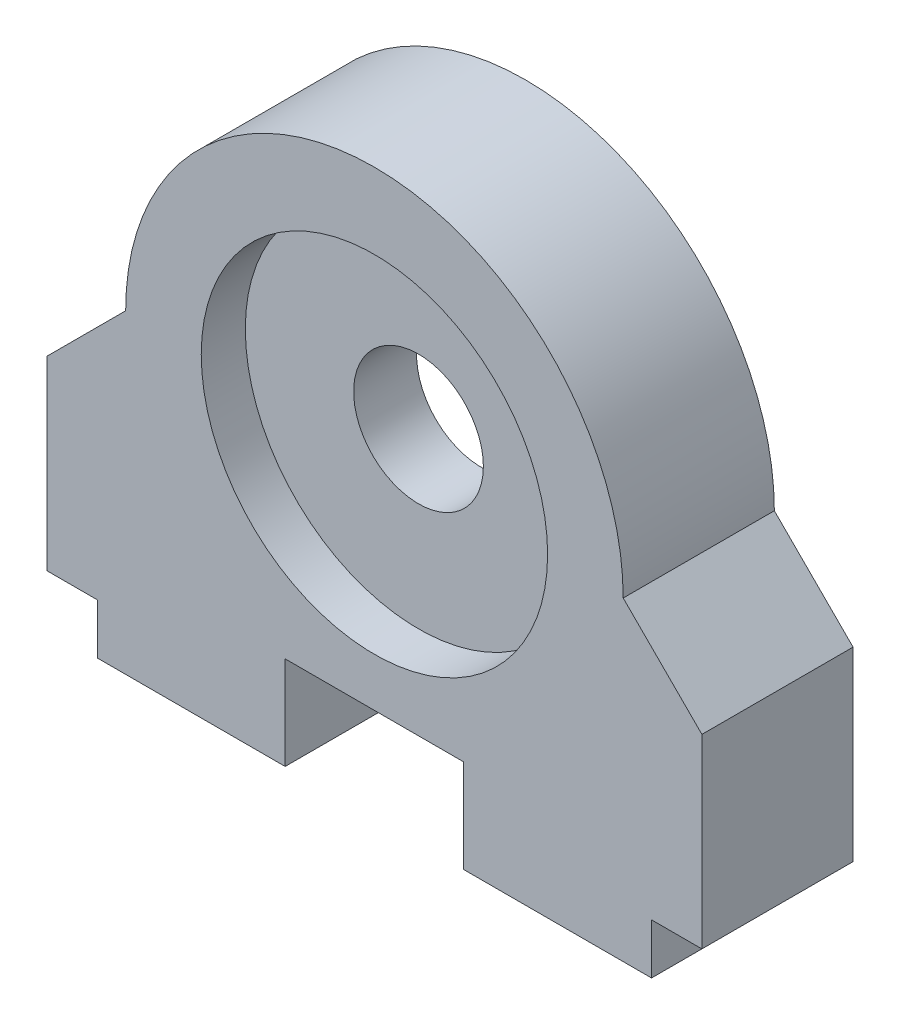
ISO-10303-21;
HEADER;
FILE_DESCRIPTION(('STEP AP214'),'2;1');
FILE_NAME('part.step','',(''),(''),'','','');
FILE_SCHEMA(('AUTOMOTIVE_DESIGN { 1 0 10303 214 1 1 1 1 }'));
ENDSEC;
DATA;
#1=APPLICATION_CONTEXT('core data for automotive mechanical design processes');
#2=APPLICATION_PROTOCOL_DEFINITION('international standard','automotive_design',2000,#1);
#3=PRODUCT_CONTEXT('',#1,'mechanical');
#4=PRODUCT('Part','Part','',(#3));
#5=PRODUCT_RELATED_PRODUCT_CATEGORY('part','',(#4));
#6=PRODUCT_DEFINITION_FORMATION('','',#4);
#7=PRODUCT_DEFINITION_CONTEXT('part definition',#1,'design');
#8=PRODUCT_DEFINITION('design','',#6,#7);
#9=PRODUCT_DEFINITION_SHAPE('','',#8);
#10=(LENGTH_UNIT() NAMED_UNIT(*) SI_UNIT(.MILLI.,.METRE.));
#11=(NAMED_UNIT(*) PLANE_ANGLE_UNIT() SI_UNIT($,.RADIAN.));
#12=(NAMED_UNIT(*) SI_UNIT($,.STERADIAN.) SOLID_ANGLE_UNIT());
#13=UNCERTAINTY_MEASURE_WITH_UNIT(LENGTH_MEASURE(1.E-05),#10,'distance_accuracy_value','');
#14=(GEOMETRIC_REPRESENTATION_CONTEXT(3) GLOBAL_UNCERTAINTY_ASSIGNED_CONTEXT((#13)) GLOBAL_UNIT_ASSIGNED_CONTEXT((#10,
#11,#12)) REPRESENTATION_CONTEXT('',''));
#15=CARTESIAN_POINT('',(0.,0.,0.));
#16=DIRECTION('',(0.,0.,1.));
#17=DIRECTION('',(1.,0.,0.));
#18=AXIS2_PLACEMENT_3D('',#15,#16,#17);
#19=CARTESIAN_POINT('',(0.,15.875,7.62));
#20=DIRECTION('',(0.,0.,-1.));
#21=DIRECTION('',(-1.,0.,0.));
#22=AXIS2_PLACEMENT_3D('',#19,#20,#21);
#23=CYLINDRICAL_SURFACE('',#22,8.73125);
#24=CARTESIAN_POINT('',(0.,15.875,0.));
#25=DIRECTION('',(0.,0.,1.));
#26=DIRECTION('',(1.,0.,0.));
#27=AXIS2_PLACEMENT_3D('',#24,#25,#26);
#28=CIRCLE('',#27,8.73125);
#29=CARTESIAN_POINT('',(8.73125,15.875,0.));
#30=VERTEX_POINT('',#29);
#31=EDGE_CURVE('E330',#30,#30,#28,.T.);
#32=ORIENTED_EDGE('',*,*,#31,.F.);
#33=EDGE_LOOP('',(#32));
#34=FACE_BOUND('',#33,.T.);
#35=CARTESIAN_POINT('',(0.,15.875,2.2225));
#36=DIRECTION('',(0.,0.,1.));
#37=DIRECTION('',(1.,0.,0.));
#38=AXIS2_PLACEMENT_3D('',#35,#36,#37);
#39=CIRCLE('',#38,8.73125);
#40=CARTESIAN_POINT('',(8.73125,15.875,2.2225));
#41=VERTEX_POINT('',#40);
#42=EDGE_CURVE('E37',#41,#41,#39,.T.);
#43=ORIENTED_EDGE('',*,*,#42,.T.);
#44=EDGE_LOOP('',(#43));
#45=FACE_BOUND('',#44,.T.);
#46=ADVANCED_FACE('F33',(#34,#45),#23,.F.);
#47=CARTESIAN_POINT('',(0.,15.875,7.62));
#48=DIRECTION('',(0.,0.,-1.));
#49=DIRECTION('',(-1.,0.,0.));
#50=AXIS2_PLACEMENT_3D('',#47,#48,#49);
#51=PLANE('',#50);
#52=DIRECTION('',(0.,-1.,0.));
#53=VECTOR('',#52,1.);
#54=CARTESIAN_POINT('',(-13.97,0.,7.62));
#55=LINE('',#54,#53);
#56=CARTESIAN_POINT('',(-13.97,2.54,7.62));
#57=VERTEX_POINT('',#56);
#58=CARTESIAN_POINT('',(-13.97,0.,7.62));
#59=VERTEX_POINT('',#58);
#60=EDGE_CURVE('E196',#57,#59,#55,.T.);
#61=ORIENTED_EDGE('',*,*,#60,.T.);
#62=DIRECTION('',(1.,0.,0.));
#63=VECTOR('',#62,1.);
#64=CARTESIAN_POINT('',(-4.5,0.,7.62));
#65=LINE('',#64,#63);
#66=CARTESIAN_POINT('',(-4.5,0.,7.62));
#67=VERTEX_POINT('',#66);
#68=EDGE_CURVE('E113',#59,#67,#65,.T.);
#69=ORIENTED_EDGE('',*,*,#68,.T.);
#70=DIRECTION('',(0.,1.,0.));
#71=VECTOR('',#70,1.);
#72=CARTESIAN_POINT('',(-4.5,4.699,7.62));
#73=LINE('',#72,#71);
#74=CARTESIAN_POINT('',(-4.5,4.699,7.62));
#75=VERTEX_POINT('',#74);
#76=EDGE_CURVE('E249',#67,#75,#73,.T.);
#77=ORIENTED_EDGE('',*,*,#76,.T.);
#78=DIRECTION('',(1.,0.,0.));
#79=VECTOR('',#78,1.);
#80=CARTESIAN_POINT('',(4.5,4.699,7.62));
#81=LINE('',#80,#79);
#82=CARTESIAN_POINT('',(4.5,4.699,7.62));
#83=VERTEX_POINT('',#82);
#84=EDGE_CURVE('E246',#75,#83,#81,.T.);
#85=ORIENTED_EDGE('',*,*,#84,.T.);
#86=DIRECTION('',(0.,-1.,0.));
#87=VECTOR('',#86,1.);
#88=CARTESIAN_POINT('',(4.5,4.699,7.62));
#89=LINE('',#88,#87);
#90=CARTESIAN_POINT('',(4.5,0.,7.62));
#91=VERTEX_POINT('',#90);
#92=EDGE_CURVE('E248',#83,#91,#89,.T.);
#93=ORIENTED_EDGE('',*,*,#92,.T.);
#94=DIRECTION('',(1.,0.,0.));
#95=VECTOR('',#94,1.);
#96=CARTESIAN_POINT('',(4.5,0.,7.62));
#97=LINE('',#96,#95);
#98=CARTESIAN_POINT('',(13.97,0.,7.62));
#99=VERTEX_POINT('',#98);
#100=EDGE_CURVE('E251',#91,#99,#97,.T.);
#101=ORIENTED_EDGE('',*,*,#100,.T.);
#102=DIRECTION('',(0.,1.,0.));
#103=VECTOR('',#102,1.);
#104=CARTESIAN_POINT('',(13.97,0.,7.62));
#105=LINE('',#104,#103);
#106=CARTESIAN_POINT('',(13.97,2.54,7.62));
#107=VERTEX_POINT('',#106);
#108=EDGE_CURVE('E257',#99,#107,#105,.T.);
#109=ORIENTED_EDGE('',*,*,#108,.T.);
#110=DIRECTION('',(1.,0.,0.));
#111=VECTOR('',#110,1.);
#112=CARTESIAN_POINT('',(16.51,2.54,7.62));
#113=LINE('',#112,#111);
#114=CARTESIAN_POINT('',(16.51,2.54,7.62));
#115=VERTEX_POINT('',#114);
#116=EDGE_CURVE('E259',#107,#115,#113,.T.);
#117=ORIENTED_EDGE('',*,*,#116,.T.);
#118=DIRECTION('',(0.,1.,0.));
#119=VECTOR('',#118,1.);
#120=CARTESIAN_POINT('',(16.51,2.54,7.62));
#121=LINE('',#120,#119);
#122=CARTESIAN_POINT('',(16.51,11.90625,7.62));
#123=VERTEX_POINT('',#122);
#124=EDGE_CURVE('E261',#115,#123,#121,.T.);
#125=ORIENTED_EDGE('',*,*,#124,.T.);
#126=DIRECTION('',(-0.707106781186549,0.707106781186546,0.));
#127=VECTOR('',#126,1.);
#128=CARTESIAN_POINT('',(16.51,11.90625,7.62));
#129=LINE('',#128,#127);
#130=CARTESIAN_POINT('',(12.54125,15.875,7.62));
#131=VERTEX_POINT('',#130);
#132=EDGE_CURVE('E263',#123,#131,#129,.T.);
#133=ORIENTED_EDGE('',*,*,#132,.T.);
#134=CARTESIAN_POINT('',(0.,15.875,7.62));
#135=DIRECTION('',(0.,0.,1.));
#136=DIRECTION('',(-1.,0.,0.));
#137=AXIS2_PLACEMENT_3D('',#134,#135,#136);
#138=CIRCLE('',#137,12.54125);
#139=CARTESIAN_POINT('',(-12.54125,15.875,7.62));
#140=VERTEX_POINT('',#139);
#141=EDGE_CURVE('E151',#131,#140,#138,.T.);
#142=ORIENTED_EDGE('',*,*,#141,.T.);
#143=DIRECTION('',(-0.707106781186549,-0.707106781186546,0.));
#144=VECTOR('',#143,1.);
#145=CARTESIAN_POINT('',(-16.51,11.90625,7.62));
#146=LINE('',#145,#144);
#147=CARTESIAN_POINT('',(-16.51,11.90625,7.62));
#148=VERTEX_POINT('',#147);
#149=EDGE_CURVE('E144',#140,#148,#146,.T.);
#150=ORIENTED_EDGE('',*,*,#149,.T.);
#151=DIRECTION('',(0.,-1.,0.));
#152=VECTOR('',#151,1.);
#153=CARTESIAN_POINT('',(-16.51,2.54,7.62));
#154=LINE('',#153,#152);
#155=CARTESIAN_POINT('',(-16.51,2.54,7.62));
#156=VERTEX_POINT('',#155);
#157=EDGE_CURVE('E149',#148,#156,#154,.T.);
#158=ORIENTED_EDGE('',*,*,#157,.T.);
#159=DIRECTION('',(1.,0.,0.));
#160=VECTOR('',#159,1.);
#161=CARTESIAN_POINT('',(-16.51,2.54,7.62));
#162=LINE('',#161,#160);
#163=EDGE_CURVE('E51',#156,#57,#162,.T.);
#164=ORIENTED_EDGE('',*,*,#163,.T.);
#165=EDGE_LOOP('',(#61,#69,#77,#85,#93,#101,#109,#117,#125,#133,#142,#150,#158,#164));
#166=FACE_BOUND('',#165,.T.);
#167=CARTESIAN_POINT('',(0.,15.875,7.62));
#168=DIRECTION('',(0.,0.,1.));
#169=DIRECTION('',(1.,0.,0.));
#170=AXIS2_PLACEMENT_3D('',#167,#168,#169);
#171=CIRCLE('',#170,8.73125);
#172=CARTESIAN_POINT('',(8.73125,15.875,7.62));
#173=VERTEX_POINT('',#172);
#174=EDGE_CURVE('E173',#173,#173,#171,.T.);
#175=ORIENTED_EDGE('',*,*,#174,.F.);
#176=EDGE_LOOP('',(#175));
#177=FACE_BOUND('',#176,.T.);
#178=ADVANCED_FACE('F146',(#166,#177),#51,.F.);
#179=CARTESIAN_POINT('',(0.,15.875,0.));
#180=DIRECTION('',(0.,0.,-1.));
#181=DIRECTION('',(-1.,0.,0.));
#182=AXIS2_PLACEMENT_3D('',#179,#180,#181);
#183=PLANE('',#182);
#184=DIRECTION('',(0.,-1.,0.));
#185=VECTOR('',#184,1.);
#186=CARTESIAN_POINT('',(-13.97,0.,0.));
#187=LINE('',#186,#185);
#188=CARTESIAN_POINT('',(-13.97,2.54,0.));
#189=VERTEX_POINT('',#188);
#190=CARTESIAN_POINT('',(-13.97,0.,0.));
#191=VERTEX_POINT('',#190);
#192=EDGE_CURVE('E169',#189,#191,#187,.T.);
#193=ORIENTED_EDGE('',*,*,#192,.F.);
#194=DIRECTION('',(1.,0.,0.));
#195=VECTOR('',#194,1.);
#196=CARTESIAN_POINT('',(-16.51,2.54,0.));
#197=LINE('',#196,#195);
#198=CARTESIAN_POINT('',(-16.51,2.54,0.));
#199=VERTEX_POINT('',#198);
#200=EDGE_CURVE('E104',#199,#189,#197,.T.);
#201=ORIENTED_EDGE('',*,*,#200,.F.);
#202=DIRECTION('',(0.,-1.,0.));
#203=VECTOR('',#202,1.);
#204=CARTESIAN_POINT('',(-16.51,2.54,0.));
#205=LINE('',#204,#203);
#206=CARTESIAN_POINT('',(-16.51,11.90625,0.));
#207=VERTEX_POINT('',#206);
#208=EDGE_CURVE('E98',#207,#199,#205,.T.);
#209=ORIENTED_EDGE('',*,*,#208,.F.);
#210=DIRECTION('',(-0.707106781186549,-0.707106781186546,0.));
#211=VECTOR('',#210,1.);
#212=CARTESIAN_POINT('',(-16.51,11.90625,0.));
#213=LINE('',#212,#211);
#214=CARTESIAN_POINT('',(-12.54125,15.875,0.));
#215=VERTEX_POINT('',#214);
#216=EDGE_CURVE('E159',#215,#207,#213,.T.);
#217=ORIENTED_EDGE('',*,*,#216,.F.);
#218=CARTESIAN_POINT('',(0.,15.875,0.));
#219=DIRECTION('',(0.,0.,1.));
#220=DIRECTION('',(-1.,0.,0.));
#221=AXIS2_PLACEMENT_3D('',#218,#219,#220);
#222=CIRCLE('',#221,12.54125);
#223=CARTESIAN_POINT('',(12.54125,15.875,0.));
#224=VERTEX_POINT('',#223);
#225=EDGE_CURVE('E191',#224,#215,#222,.T.);
#226=ORIENTED_EDGE('',*,*,#225,.F.);
#227=DIRECTION('',(-0.707106781186549,0.707106781186546,0.));
#228=VECTOR('',#227,1.);
#229=CARTESIAN_POINT('',(16.51,11.90625,0.));
#230=LINE('',#229,#228);
#231=CARTESIAN_POINT('',(16.51,11.90625,0.));
#232=VERTEX_POINT('',#231);
#233=EDGE_CURVE('E189',#232,#224,#230,.T.);
#234=ORIENTED_EDGE('',*,*,#233,.F.);
#235=DIRECTION('',(0.,1.,0.));
#236=VECTOR('',#235,1.);
#237=CARTESIAN_POINT('',(16.51,2.54,0.));
#238=LINE('',#237,#236);
#239=CARTESIAN_POINT('',(16.51,2.54,0.));
#240=VERTEX_POINT('',#239);
#241=EDGE_CURVE('E187',#240,#232,#238,.T.);
#242=ORIENTED_EDGE('',*,*,#241,.F.);
#243=DIRECTION('',(1.,0.,0.));
#244=VECTOR('',#243,1.);
#245=CARTESIAN_POINT('',(16.51,2.54,0.));
#246=LINE('',#245,#244);
#247=CARTESIAN_POINT('',(13.97,2.54,0.));
#248=VERTEX_POINT('',#247);
#249=EDGE_CURVE('E185',#248,#240,#246,.T.);
#250=ORIENTED_EDGE('',*,*,#249,.F.);
#251=DIRECTION('',(0.,1.,0.));
#252=VECTOR('',#251,1.);
#253=CARTESIAN_POINT('',(13.97,0.,0.));
#254=LINE('',#253,#252);
#255=CARTESIAN_POINT('',(13.97,0.,0.));
#256=VERTEX_POINT('',#255);
#257=EDGE_CURVE('E183',#256,#248,#254,.T.);
#258=ORIENTED_EDGE('',*,*,#257,.F.);
#259=DIRECTION('',(1.,0.,0.));
#260=VECTOR('',#259,1.);
#261=CARTESIAN_POINT('',(4.5,0.,0.));
#262=LINE('',#261,#260);
#263=CARTESIAN_POINT('',(4.5,0.,0.));
#264=VERTEX_POINT('',#263);
#265=EDGE_CURVE('E181',#264,#256,#262,.T.);
#266=ORIENTED_EDGE('',*,*,#265,.F.);
#267=DIRECTION('',(0.,-1.,0.));
#268=VECTOR('',#267,1.);
#269=CARTESIAN_POINT('',(4.5,4.699,0.));
#270=LINE('',#269,#268);
#271=CARTESIAN_POINT('',(4.5,4.699,0.));
#272=VERTEX_POINT('',#271);
#273=EDGE_CURVE('E179',#272,#264,#270,.T.);
#274=ORIENTED_EDGE('',*,*,#273,.F.);
#275=DIRECTION('',(1.,0.,0.));
#276=VECTOR('',#275,1.);
#277=CARTESIAN_POINT('',(4.5,4.699,0.));
#278=LINE('',#277,#276);
#279=CARTESIAN_POINT('',(-4.5,4.699,0.));
#280=VERTEX_POINT('',#279);
#281=EDGE_CURVE('E177',#280,#272,#278,.T.);
#282=ORIENTED_EDGE('',*,*,#281,.F.);
#283=DIRECTION('',(0.,1.,0.));
#284=VECTOR('',#283,1.);
#285=CARTESIAN_POINT('',(-4.5,4.699,0.));
#286=LINE('',#285,#284);
#287=CARTESIAN_POINT('',(-4.5,0.,0.));
#288=VERTEX_POINT('',#287);
#289=EDGE_CURVE('E175',#288,#280,#286,.T.);
#290=ORIENTED_EDGE('',*,*,#289,.F.);
#291=DIRECTION('',(1.,0.,0.));
#292=VECTOR('',#291,1.);
#293=CARTESIAN_POINT('',(-4.5,0.,0.));
#294=LINE('',#293,#292);
#295=EDGE_CURVE('E172',#191,#288,#294,.T.);
#296=ORIENTED_EDGE('',*,*,#295,.F.);
#297=EDGE_LOOP('',(#193,#201,#209,#217,#226,#234,#242,#250,#258,#266,#274,#282,#290,#296));
#298=FACE_BOUND('',#297,.T.);
#299=ORIENTED_EDGE('',*,*,#31,.T.);
#300=EDGE_LOOP('',(#299));
#301=FACE_BOUND('',#300,.T.);
#302=ADVANCED_FACE('F233',(#298,#301),#183,.T.);
#303=CARTESIAN_POINT('',(-13.97,0.,7.62));
#304=DIRECTION('',(1.,0.,0.));
#305=DIRECTION('',(0.,0.,-1.));
#306=AXIS2_PLACEMENT_3D('',#303,#304,#305);
#307=PLANE('',#306);
#308=ORIENTED_EDGE('',*,*,#192,.T.);
#309=DIRECTION('',(0.,0.,-1.));
#310=VECTOR('',#309,1.);
#311=CARTESIAN_POINT('',(-13.97,0.,7.62));
#312=LINE('',#311,#310);
#313=EDGE_CURVE('E43',#59,#191,#312,.T.);
#314=ORIENTED_EDGE('',*,*,#313,.F.);
#315=ORIENTED_EDGE('',*,*,#60,.F.);
#316=DIRECTION('',(0.,0.,-1.));
#317=VECTOR('',#316,1.);
#318=CARTESIAN_POINT('',(-13.97,2.54,7.62));
#319=LINE('',#318,#317);
#320=EDGE_CURVE('E165',#57,#189,#319,.T.);
#321=ORIENTED_EDGE('',*,*,#320,.T.);
#322=EDGE_LOOP('',(#308,#314,#315,#321));
#323=FACE_BOUND('',#322,.T.);
#324=ADVANCED_FACE('F35',(#323),#307,.F.);
#325=CARTESIAN_POINT('',(-4.5,0.,7.62));
#326=DIRECTION('',(0.,1.,0.));
#327=DIRECTION('',(-1.,0.,0.));
#328=AXIS2_PLACEMENT_3D('',#325,#326,#327);
#329=PLANE('',#328);
#330=CARTESIAN_POINT('',(-10.16,0.,3.81));
#331=DIRECTION('',(0.,-1.,0.));
#332=DIRECTION('',(-1.,0.,0.));
#333=AXIS2_PLACEMENT_3D('',#330,#331,#332);
#334=CIRCLE('',#333,1.98374);
#335=CARTESIAN_POINT('',(-12.14374,0.,3.81));
#336=VERTEX_POINT('',#335);
#337=EDGE_CURVE('E349',#336,#336,#334,.T.);
#338=ORIENTED_EDGE('',*,*,#337,.F.);
#339=EDGE_LOOP('',(#338));
#340=FACE_BOUND('',#339,.T.);
#341=ORIENTED_EDGE('',*,*,#295,.T.);
#342=DIRECTION('',(0.,0.,-1.));
#343=VECTOR('',#342,1.);
#344=CARTESIAN_POINT('',(-4.5,0.,7.62));
#345=LINE('',#344,#343);
#346=EDGE_CURVE('E224',#67,#288,#345,.T.);
#347=ORIENTED_EDGE('',*,*,#346,.F.);
#348=ORIENTED_EDGE('',*,*,#68,.F.);
#349=ORIENTED_EDGE('',*,*,#313,.T.);
#350=EDGE_LOOP('',(#341,#347,#348,#349));
#351=FACE_BOUND('',#350,.T.);
#352=ADVANCED_FACE('F228',(#340,#351),#329,.F.);
#353=CARTESIAN_POINT('',(-4.5,4.699,7.62));
#354=DIRECTION('',(-1.,0.,0.));
#355=DIRECTION('',(0.,0.,1.));
#356=AXIS2_PLACEMENT_3D('',#353,#354,#355);
#357=PLANE('',#356);
#358=ORIENTED_EDGE('',*,*,#289,.T.);
#359=DIRECTION('',(0.,0.,-1.));
#360=VECTOR('',#359,1.);
#361=CARTESIAN_POINT('',(-4.5,4.699,7.62));
#362=LINE('',#361,#360);
#363=EDGE_CURVE('E221',#75,#280,#362,.T.);
#364=ORIENTED_EDGE('',*,*,#363,.F.);
#365=ORIENTED_EDGE('',*,*,#76,.F.);
#366=ORIENTED_EDGE('',*,*,#346,.T.);
#367=EDGE_LOOP('',(#358,#364,#365,#366));
#368=FACE_BOUND('',#367,.T.);
#369=ADVANCED_FACE('F240',(#368),#357,.F.);
#370=CARTESIAN_POINT('',(4.5,4.699,7.62));
#371=DIRECTION('',(0.,1.,0.));
#372=DIRECTION('',(0.,0.,1.));
#373=AXIS2_PLACEMENT_3D('',#370,#371,#372);
#374=PLANE('',#373);
#375=ORIENTED_EDGE('',*,*,#281,.T.);
#376=DIRECTION('',(0.,0.,-1.));
#377=VECTOR('',#376,1.);
#378=CARTESIAN_POINT('',(4.5,4.699,7.62));
#379=LINE('',#378,#377);
#380=EDGE_CURVE('E218',#83,#272,#379,.T.);
#381=ORIENTED_EDGE('',*,*,#380,.F.);
#382=ORIENTED_EDGE('',*,*,#84,.F.);
#383=ORIENTED_EDGE('',*,*,#363,.T.);
#384=EDGE_LOOP('',(#375,#381,#382,#383));
#385=FACE_BOUND('',#384,.T.);
#386=ADVANCED_FACE('F244',(#385),#374,.F.);
#387=CARTESIAN_POINT('',(4.5,4.699,7.62));
#388=DIRECTION('',(1.,0.,0.));
#389=DIRECTION('',(0.,0.,-1.));
#390=AXIS2_PLACEMENT_3D('',#387,#388,#389);
#391=PLANE('',#390);
#392=ORIENTED_EDGE('',*,*,#273,.T.);
#393=DIRECTION('',(0.,0.,-1.));
#394=VECTOR('',#393,1.);
#395=CARTESIAN_POINT('',(4.5,0.,7.62));
#396=LINE('',#395,#394);
#397=EDGE_CURVE('E215',#91,#264,#396,.T.);
#398=ORIENTED_EDGE('',*,*,#397,.F.);
#399=ORIENTED_EDGE('',*,*,#92,.F.);
#400=ORIENTED_EDGE('',*,*,#380,.T.);
#401=EDGE_LOOP('',(#392,#398,#399,#400));
#402=FACE_BOUND('',#401,.T.);
#403=ADVANCED_FACE('F294',(#402),#391,.F.);
#404=CARTESIAN_POINT('',(4.5,0.,7.62));
#405=DIRECTION('',(0.,1.,0.));
#406=DIRECTION('',(-1.,0.,0.));
#407=AXIS2_PLACEMENT_3D('',#404,#405,#406);
#408=PLANE('',#407);
#409=CARTESIAN_POINT('',(10.16,0.,3.81));
#410=DIRECTION('',(0.,-1.,0.));
#411=DIRECTION('',(1.,0.,0.));
#412=AXIS2_PLACEMENT_3D('',#409,#410,#411);
#413=CIRCLE('',#412,1.98374);
#414=CARTESIAN_POINT('',(12.14374,0.,3.81));
#415=VERTEX_POINT('',#414);
#416=EDGE_CURVE('E343',#415,#415,#413,.T.);
#417=ORIENTED_EDGE('',*,*,#416,.F.);
#418=EDGE_LOOP('',(#417));
#419=FACE_BOUND('',#418,.T.);
#420=ORIENTED_EDGE('',*,*,#265,.T.);
#421=DIRECTION('',(0.,0.,-1.));
#422=VECTOR('',#421,1.);
#423=CARTESIAN_POINT('',(13.97,0.,7.62));
#424=LINE('',#423,#422);
#425=EDGE_CURVE('E212',#99,#256,#424,.T.);
#426=ORIENTED_EDGE('',*,*,#425,.F.);
#427=ORIENTED_EDGE('',*,*,#100,.F.);
#428=ORIENTED_EDGE('',*,*,#397,.T.);
#429=EDGE_LOOP('',(#420,#426,#427,#428));
#430=FACE_BOUND('',#429,.T.);
#431=ADVANCED_FACE('F290',(#419,#430),#408,.F.);
#432=CARTESIAN_POINT('',(13.97,0.,7.62));
#433=DIRECTION('',(-1.,0.,0.));
#434=DIRECTION('',(0.,0.,1.));
#435=AXIS2_PLACEMENT_3D('',#432,#433,#434);
#436=PLANE('',#435);
#437=ORIENTED_EDGE('',*,*,#257,.T.);
#438=DIRECTION('',(0.,0.,-1.));
#439=VECTOR('',#438,1.);
#440=CARTESIAN_POINT('',(13.97,2.54,7.62));
#441=LINE('',#440,#439);
#442=EDGE_CURVE('E209',#107,#248,#441,.T.);
#443=ORIENTED_EDGE('',*,*,#442,.F.);
#444=ORIENTED_EDGE('',*,*,#108,.F.);
#445=ORIENTED_EDGE('',*,*,#425,.T.);
#446=EDGE_LOOP('',(#437,#443,#444,#445));
#447=FACE_BOUND('',#446,.T.);
#448=ADVANCED_FACE('F286',(#447),#436,.F.);
#449=CARTESIAN_POINT('',(16.51,2.54,7.62));
#450=DIRECTION('',(0.,1.,0.));
#451=DIRECTION('',(0.,0.,1.));
#452=AXIS2_PLACEMENT_3D('',#449,#450,#451);
#453=PLANE('',#452);
#454=ORIENTED_EDGE('',*,*,#249,.T.);
#455=DIRECTION('',(0.,0.,-1.));
#456=VECTOR('',#455,1.);
#457=CARTESIAN_POINT('',(16.51,2.54,7.62));
#458=LINE('',#457,#456);
#459=EDGE_CURVE('E206',#115,#240,#458,.T.);
#460=ORIENTED_EDGE('',*,*,#459,.F.);
#461=ORIENTED_EDGE('',*,*,#116,.F.);
#462=ORIENTED_EDGE('',*,*,#442,.T.);
#463=EDGE_LOOP('',(#454,#460,#461,#462));
#464=FACE_BOUND('',#463,.T.);
#465=ADVANCED_FACE('F282',(#464),#453,.F.);
#466=CARTESIAN_POINT('',(16.51,2.54,7.62));
#467=DIRECTION('',(-1.,0.,0.));
#468=DIRECTION('',(0.,0.,1.));
#469=AXIS2_PLACEMENT_3D('',#466,#467,#468);
#470=PLANE('',#469);
#471=ORIENTED_EDGE('',*,*,#241,.T.);
#472=DIRECTION('',(0.,0.,-1.));
#473=VECTOR('',#472,1.);
#474=CARTESIAN_POINT('',(16.51,11.90625,7.62));
#475=LINE('',#474,#473);
#476=EDGE_CURVE('E203',#123,#232,#475,.T.);
#477=ORIENTED_EDGE('',*,*,#476,.F.);
#478=ORIENTED_EDGE('',*,*,#124,.F.);
#479=ORIENTED_EDGE('',*,*,#459,.T.);
#480=EDGE_LOOP('',(#471,#477,#478,#479));
#481=FACE_BOUND('',#480,.T.);
#482=ADVANCED_FACE('F278',(#481),#470,.F.);
#483=CARTESIAN_POINT('',(16.51,11.90625,7.62));
#484=DIRECTION('',(-0.707106781186546,-0.707106781186549,0.));
#485=DIRECTION('',(0.707106781186549,-0.707106781186546,0.));
#486=AXIS2_PLACEMENT_3D('',#483,#484,#485);
#487=PLANE('',#486);
#488=ORIENTED_EDGE('',*,*,#233,.T.);
#489=DIRECTION('',(0.,0.,-1.));
#490=VECTOR('',#489,1.);
#491=CARTESIAN_POINT('',(12.54125,15.875,7.62));
#492=LINE('',#491,#490);
#493=EDGE_CURVE('E200',#131,#224,#492,.T.);
#494=ORIENTED_EDGE('',*,*,#493,.F.);
#495=ORIENTED_EDGE('',*,*,#132,.F.);
#496=ORIENTED_EDGE('',*,*,#476,.T.);
#497=EDGE_LOOP('',(#488,#494,#495,#496));
#498=FACE_BOUND('',#497,.T.);
#499=ADVANCED_FACE('F269',(#498),#487,.F.);
#500=CARTESIAN_POINT('',(0.,15.875,7.62));
#501=DIRECTION('',(0.,0.,-1.));
#502=DIRECTION('',(-1.,0.,0.));
#503=AXIS2_PLACEMENT_3D('',#500,#501,#502);
#504=CYLINDRICAL_SURFACE('',#503,12.54125);
#505=ORIENTED_EDGE('',*,*,#225,.T.);
#506=DIRECTION('',(0.,0.,-1.));
#507=VECTOR('',#506,1.);
#508=CARTESIAN_POINT('',(-12.54125,15.875,7.62));
#509=LINE('',#508,#507);
#510=EDGE_CURVE('E160',#140,#215,#509,.T.);
#511=ORIENTED_EDGE('',*,*,#510,.F.);
#512=ORIENTED_EDGE('',*,*,#141,.F.);
#513=ORIENTED_EDGE('',*,*,#493,.T.);
#514=EDGE_LOOP('',(#505,#511,#512,#513));
#515=FACE_BOUND('',#514,.T.);
#516=ADVANCED_FACE('F273',(#515),#504,.T.);
#517=CARTESIAN_POINT('',(-16.51,11.90625,7.62));
#518=DIRECTION('',(0.707106781186546,-0.707106781186549,0.));
#519=DIRECTION('',(0.707106781186549,0.707106781186546,0.));
#520=AXIS2_PLACEMENT_3D('',#517,#518,#519);
#521=PLANE('',#520);
#522=ORIENTED_EDGE('',*,*,#216,.T.);
#523=DIRECTION('',(0.,0.,-1.));
#524=VECTOR('',#523,1.);
#525=CARTESIAN_POINT('',(-16.51,11.90625,7.62));
#526=LINE('',#525,#524);
#527=EDGE_CURVE('E156',#148,#207,#526,.T.);
#528=ORIENTED_EDGE('',*,*,#527,.F.);
#529=ORIENTED_EDGE('',*,*,#149,.F.);
#530=ORIENTED_EDGE('',*,*,#510,.T.);
#531=EDGE_LOOP('',(#522,#528,#529,#530));
#532=FACE_BOUND('',#531,.T.);
#533=ADVANCED_FACE('F157',(#532),#521,.F.);
#534=CARTESIAN_POINT('',(-16.51,2.54,7.62));
#535=DIRECTION('',(1.,0.,0.));
#536=DIRECTION('',(0.,0.,-1.));
#537=AXIS2_PLACEMENT_3D('',#534,#535,#536);
#538=PLANE('',#537);
#539=ORIENTED_EDGE('',*,*,#208,.T.);
#540=DIRECTION('',(0.,0.,-1.));
#541=VECTOR('',#540,1.);
#542=CARTESIAN_POINT('',(-16.51,2.54,7.62));
#543=LINE('',#542,#541);
#544=EDGE_CURVE('E161',#156,#199,#543,.T.);
#545=ORIENTED_EDGE('',*,*,#544,.F.);
#546=ORIENTED_EDGE('',*,*,#157,.F.);
#547=ORIENTED_EDGE('',*,*,#527,.T.);
#548=EDGE_LOOP('',(#539,#545,#546,#547));
#549=FACE_BOUND('',#548,.T.);
#550=ADVANCED_FACE('F163',(#549),#538,.F.);
#551=CARTESIAN_POINT('',(-16.51,2.54,7.62));
#552=DIRECTION('',(0.,1.,0.));
#553=DIRECTION('',(0.,0.,1.));
#554=AXIS2_PLACEMENT_3D('',#551,#552,#553);
#555=PLANE('',#554);
#556=ORIENTED_EDGE('',*,*,#200,.T.);
#557=ORIENTED_EDGE('',*,*,#320,.F.);
#558=ORIENTED_EDGE('',*,*,#163,.F.);
#559=ORIENTED_EDGE('',*,*,#544,.T.);
#560=EDGE_LOOP('',(#556,#557,#558,#559));
#561=FACE_BOUND('',#560,.T.);
#562=ADVANCED_FACE('F317',(#561),#555,.F.);
#563=CARTESIAN_POINT('',(0.,15.875,5.3975));
#564=DIRECTION('',(0.,0.,1.));
#565=DIRECTION('',(1.,0.,0.));
#566=AXIS2_PLACEMENT_3D('',#563,#564,#565);
#567=CIRCLE('',#566,8.73125);
#568=CARTESIAN_POINT('',(8.73125,15.875,5.3975));
#569=VERTEX_POINT('',#568);
#570=EDGE_CURVE('E11',#569,#569,#567,.T.);
#571=ORIENTED_EDGE('',*,*,#570,.F.);
#572=EDGE_LOOP('',(#571));
#573=FACE_BOUND('',#572,.T.);
#574=ORIENTED_EDGE('',*,*,#174,.T.);
#575=EDGE_LOOP('',(#574));
#576=FACE_BOUND('',#575,.T.);
#577=ADVANCED_FACE('F307',(#573,#576),#23,.F.);
#578=CARTESIAN_POINT('',(0.,15.875,2.2225));
#579=DIRECTION('',(0.,0.,1.));
#580=DIRECTION('',(1.,0.,0.));
#581=AXIS2_PLACEMENT_3D('',#578,#579,#580);
#582=PLANE('',#581);
#583=CARTESIAN_POINT('',(0.,15.875,2.2225));
#584=DIRECTION('',(0.,0.,1.));
#585=DIRECTION('',(1.,0.,0.));
#586=AXIS2_PLACEMENT_3D('',#583,#584,#585);
#587=CIRCLE('',#586,3.27025);
#588=CARTESIAN_POINT('',(3.27025,15.875,2.2225));
#589=VERTEX_POINT('',#588);
#590=EDGE_CURVE('E335',#589,#589,#587,.T.);
#591=ORIENTED_EDGE('',*,*,#590,.T.);
#592=EDGE_LOOP('',(#591));
#593=FACE_BOUND('',#592,.T.);
#594=ORIENTED_EDGE('',*,*,#42,.F.);
#595=EDGE_LOOP('',(#594));
#596=FACE_BOUND('',#595,.T.);
#597=ADVANCED_FACE('F316',(#593,#596),#582,.F.);
#598=CARTESIAN_POINT('',(0.,15.875,5.3975));
#599=DIRECTION('',(0.,0.,1.));
#600=DIRECTION('',(1.,0.,0.));
#601=AXIS2_PLACEMENT_3D('',#598,#599,#600);
#602=PLANE('',#601);
#603=CARTESIAN_POINT('',(0.,15.875,5.3975));
#604=DIRECTION('',(0.,0.,1.));
#605=DIRECTION('',(1.,0.,0.));
#606=AXIS2_PLACEMENT_3D('',#603,#604,#605);
#607=CIRCLE('',#606,3.27025);
#608=CARTESIAN_POINT('',(3.27025,15.875,5.3975));
#609=VERTEX_POINT('',#608);
#610=EDGE_CURVE('E339',#609,#609,#607,.T.);
#611=ORIENTED_EDGE('',*,*,#610,.F.);
#612=EDGE_LOOP('',(#611));
#613=FACE_BOUND('',#612,.T.);
#614=ORIENTED_EDGE('',*,*,#570,.T.);
#615=EDGE_LOOP('',(#614));
#616=FACE_BOUND('',#615,.T.);
#617=ADVANCED_FACE('F323',(#613,#616),#602,.T.);
#618=CARTESIAN_POINT('',(0.,15.875,2.2225));
#619=DIRECTION('',(0.,0.,1.));
#620=DIRECTION('',(1.,0.,0.));
#621=AXIS2_PLACEMENT_3D('',#618,#619,#620);
#622=CYLINDRICAL_SURFACE('',#621,3.27025);
#623=ORIENTED_EDGE('',*,*,#590,.F.);
#624=EDGE_LOOP('',(#623));
#625=FACE_BOUND('',#624,.T.);
#626=ORIENTED_EDGE('',*,*,#610,.T.);
#627=EDGE_LOOP('',(#626));
#628=FACE_BOUND('',#627,.T.);
#629=ADVANCED_FACE('F445',(#625,#628),#622,.F.);
#630=CARTESIAN_POINT('',(10.16,10.16,3.81));
#631=DIRECTION('',(0.,-1.,0.));
#632=DIRECTION('',(1.,0.,0.));
#633=AXIS2_PLACEMENT_3D('',#630,#631,#632);
#634=CYLINDRICAL_SURFACE('',#633,1.98374);
#635=CARTESIAN_POINT('',(10.16,10.16,3.81));
#636=DIRECTION('',(0.,-1.,0.));
#637=DIRECTION('',(1.,0.,0.));
#638=AXIS2_PLACEMENT_3D('',#635,#636,#637);
#639=CIRCLE('',#638,1.98374);
#640=CARTESIAN_POINT('',(12.14374,10.16,3.81));
#641=VERTEX_POINT('',#640);
#642=EDGE_CURVE('E342',#641,#641,#639,.T.);
#643=ORIENTED_EDGE('',*,*,#642,.F.);
#644=EDGE_LOOP('',(#643));
#645=FACE_BOUND('',#644,.T.);
#646=ORIENTED_EDGE('',*,*,#416,.T.);
#647=EDGE_LOOP('',(#646));
#648=FACE_BOUND('',#647,.T.);
#649=ADVANCED_FACE('F454',(#645,#648),#634,.F.);
#650=CARTESIAN_POINT('',(10.16,10.16,3.81));
#651=DIRECTION('',(0.,-1.,0.));
#652=DIRECTION('',(1.,0.,0.));
#653=AXIS2_PLACEMENT_3D('',#650,#651,#652);
#654=PLANE('',#653);
#655=ORIENTED_EDGE('',*,*,#642,.T.);
#656=EDGE_LOOP('',(#655));
#657=FACE_BOUND('',#656,.T.);
#658=ADVANCED_FACE('F360',(#657),#654,.T.);
#659=CARTESIAN_POINT('',(-10.16,10.16,3.81));
#660=DIRECTION('',(0.,-1.,0.));
#661=DIRECTION('',(1.,0.,0.));
#662=AXIS2_PLACEMENT_3D('',#659,#660,#661);
#663=CYLINDRICAL_SURFACE('',#662,1.98374);
#664=CARTESIAN_POINT('',(-10.16,10.16,3.81));
#665=DIRECTION('',(0.,-1.,0.));
#666=DIRECTION('',(-1.,0.,0.));
#667=AXIS2_PLACEMENT_3D('',#664,#665,#666);
#668=CIRCLE('',#667,1.98374);
#669=CARTESIAN_POINT('',(-12.14374,10.16,3.81));
#670=VERTEX_POINT('',#669);
#671=EDGE_CURVE('E346',#670,#670,#668,.T.);
#672=ORIENTED_EDGE('',*,*,#671,.F.);
#673=EDGE_LOOP('',(#672));
#674=FACE_BOUND('',#673,.T.);
#675=ORIENTED_EDGE('',*,*,#337,.T.);
#676=EDGE_LOOP('',(#675));
#677=FACE_BOUND('',#676,.T.);
#678=ADVANCED_FACE('F357',(#674,#677),#663,.F.);
#679=CARTESIAN_POINT('',(-10.16,10.16,3.81));
#680=DIRECTION('',(0.,1.,0.));
#681=DIRECTION('',(-1.,0.,0.));
#682=AXIS2_PLACEMENT_3D('',#679,#680,#681);
#683=PLANE('',#682);
#684=ORIENTED_EDGE('',*,*,#671,.T.);
#685=EDGE_LOOP('',(#684));
#686=FACE_BOUND('',#685,.T.);
#687=ADVANCED_FACE('F355',(#686),#683,.F.);
#688=CLOSED_SHELL('',(#46,#178,#302,#324,#352,#369,#386,#403,#431,#448,#465,#482,#499,#516,#533,
#550,#562,#577,#597,#617,#629,#649,#658,#678,#687));
#689=MANIFOLD_SOLID_BREP('B2',#688);
#690=ADVANCED_BREP_SHAPE_REPRESENTATION('',(#18,#689),#14);
#691=SHAPE_DEFINITION_REPRESENTATION(#9,#690);
ENDSEC;
END-ISO-10303-21;
